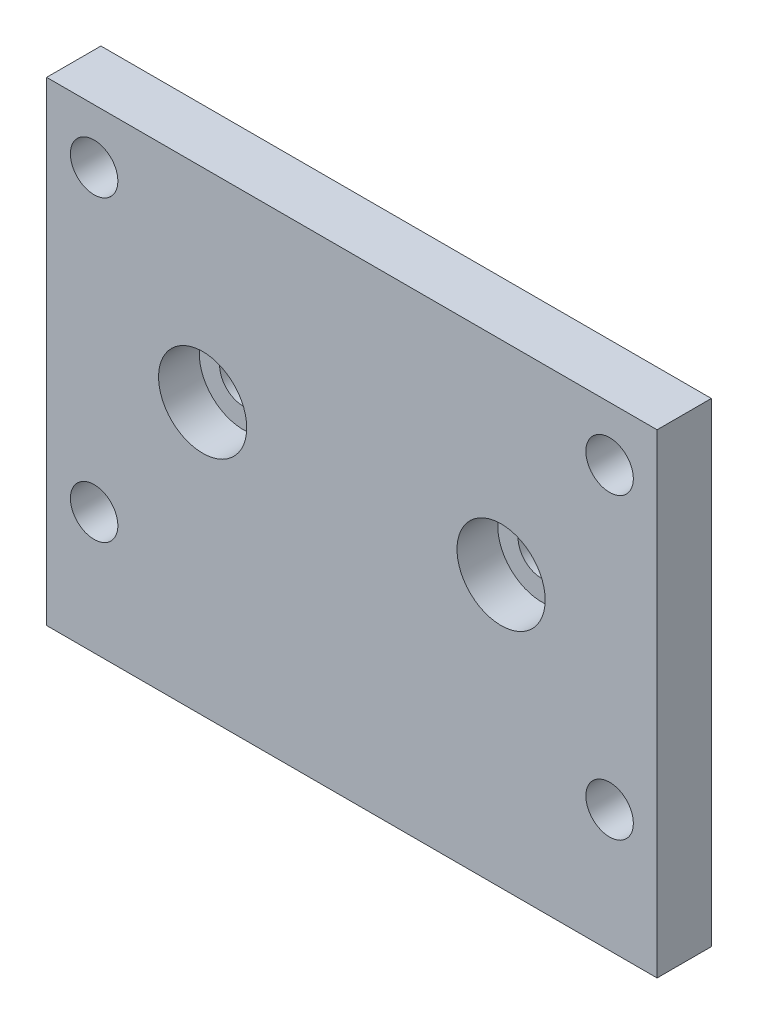
ISO-10303-21;
HEADER;
FILE_DESCRIPTION(('STEP AP214'),'2;1');
FILE_NAME('part.step','',(''),(''),'','','');
FILE_SCHEMA(('AUTOMOTIVE_DESIGN { 1 0 10303 214 1 1 1 1 }'));
ENDSEC;
DATA;
#1=APPLICATION_CONTEXT('core data for automotive mechanical design processes');
#2=APPLICATION_PROTOCOL_DEFINITION('international standard','automotive_design',2000,#1);
#3=PRODUCT_CONTEXT('',#1,'mechanical');
#4=PRODUCT('Part','Part','',(#3));
#5=PRODUCT_RELATED_PRODUCT_CATEGORY('part','',(#4));
#6=PRODUCT_DEFINITION_FORMATION('','',#4);
#7=PRODUCT_DEFINITION_CONTEXT('part definition',#1,'design');
#8=PRODUCT_DEFINITION('design','',#6,#7);
#9=PRODUCT_DEFINITION_SHAPE('','',#8);
#10=(LENGTH_UNIT() NAMED_UNIT(*) SI_UNIT(.MILLI.,.METRE.));
#11=(NAMED_UNIT(*) PLANE_ANGLE_UNIT() SI_UNIT($,.RADIAN.));
#12=(NAMED_UNIT(*) SI_UNIT($,.STERADIAN.) SOLID_ANGLE_UNIT());
#13=UNCERTAINTY_MEASURE_WITH_UNIT(LENGTH_MEASURE(1.E-05),#10,'distance_accuracy_value','');
#14=(GEOMETRIC_REPRESENTATION_CONTEXT(3) GLOBAL_UNCERTAINTY_ASSIGNED_CONTEXT((#13)) GLOBAL_UNIT_ASSIGNED_CONTEXT((#10,
#11,#12)) REPRESENTATION_CONTEXT('',''));
#15=CARTESIAN_POINT('',(0.,0.,0.));
#16=DIRECTION('',(0.,0.,1.));
#17=DIRECTION('',(1.,0.,0.));
#18=AXIS2_PLACEMENT_3D('',#15,#16,#17);
#19=CARTESIAN_POINT('',(11.,2.5,0.));
#20=DIRECTION('',(0.,0.,1.));
#21=DIRECTION('',(1.,0.,0.));
#22=AXIS2_PLACEMENT_3D('',#19,#20,#21);
#23=CYLINDRICAL_SURFACE('',#22,1.75);
#24=CARTESIAN_POINT('',(11.,2.5,0.));
#25=DIRECTION('',(0.,0.,1.));
#26=DIRECTION('',(1.,0.,0.));
#27=AXIS2_PLACEMENT_3D('',#24,#25,#26);
#28=CIRCLE('',#27,1.75);
#29=CARTESIAN_POINT('',(12.75,2.5,0.));
#30=VERTEX_POINT('',#29);
#31=EDGE_CURVE('E111',#30,#30,#28,.T.);
#32=ORIENTED_EDGE('',*,*,#31,.F.);
#33=EDGE_LOOP('',(#32));
#34=FACE_BOUND('',#33,.T.);
#35=CARTESIAN_POINT('',(11.,2.5,1.));
#36=DIRECTION('',(0.,0.,1.));
#37=DIRECTION('',(1.,0.,0.));
#38=AXIS2_PLACEMENT_3D('',#35,#36,#37);
#39=CIRCLE('',#38,1.75);
#40=CARTESIAN_POINT('',(12.75,2.5,1.));
#41=VERTEX_POINT('',#40);
#42=EDGE_CURVE('E38',#41,#41,#39,.F.);
#43=ORIENTED_EDGE('',*,*,#42,.F.);
#44=EDGE_LOOP('',(#43));
#45=FACE_BOUND('',#44,.T.);
#46=ADVANCED_FACE('F34',(#34,#45),#23,.F.);
#47=CARTESIAN_POINT('',(-11.,2.5,0.));
#48=DIRECTION('',(0.,0.,1.));
#49=DIRECTION('',(1.,0.,0.));
#50=AXIS2_PLACEMENT_3D('',#47,#48,#49);
#51=CYLINDRICAL_SURFACE('',#50,1.75);
#52=CARTESIAN_POINT('',(-11.,2.5,0.));
#53=DIRECTION('',(0.,0.,1.));
#54=DIRECTION('',(1.,0.,0.));
#55=AXIS2_PLACEMENT_3D('',#52,#53,#54);
#56=CIRCLE('',#55,1.75);
#57=CARTESIAN_POINT('',(-9.25,2.5,0.));
#58=VERTEX_POINT('',#57);
#59=EDGE_CURVE('E116',#58,#58,#56,.T.);
#60=ORIENTED_EDGE('',*,*,#59,.F.);
#61=EDGE_LOOP('',(#60));
#62=FACE_BOUND('',#61,.T.);
#63=CARTESIAN_POINT('',(-11.,2.5,1.));
#64=DIRECTION('',(0.,0.,1.));
#65=DIRECTION('',(1.,0.,0.));
#66=AXIS2_PLACEMENT_3D('',#63,#64,#65);
#67=CIRCLE('',#66,1.75);
#68=CARTESIAN_POINT('',(-9.25,2.5,1.));
#69=VERTEX_POINT('',#68);
#70=EDGE_CURVE('E109',#69,#69,#67,.F.);
#71=ORIENTED_EDGE('',*,*,#70,.F.);
#72=EDGE_LOOP('',(#71));
#73=FACE_BOUND('',#72,.T.);
#74=ADVANCED_FACE('F175',(#62,#73),#51,.F.);
#75=CARTESIAN_POINT('',(-22.5,-17.5,4.));
#76=DIRECTION('',(1.,0.,0.));
#77=DIRECTION('',(0.,0.,-1.));
#78=AXIS2_PLACEMENT_3D('',#75,#76,#77);
#79=PLANE('',#78);
#80=DIRECTION('',(0.,-1.,0.));
#81=VECTOR('',#80,1.);
#82=CARTESIAN_POINT('',(-22.5,-17.5,0.));
#83=LINE('',#82,#81);
#84=CARTESIAN_POINT('',(-22.5,17.5,0.));
#85=VERTEX_POINT('',#84);
#86=CARTESIAN_POINT('',(-22.5,-17.5,0.));
#87=VERTEX_POINT('',#86);
#88=EDGE_CURVE('E101',#85,#87,#83,.T.);
#89=ORIENTED_EDGE('',*,*,#88,.T.);
#90=DIRECTION('',(0.,0.,-1.));
#91=VECTOR('',#90,1.);
#92=CARTESIAN_POINT('',(-22.5,-17.5,4.));
#93=LINE('',#92,#91);
#94=CARTESIAN_POINT('',(-22.5,-17.5,4.));
#95=VERTEX_POINT('',#94);
#96=EDGE_CURVE('E11',#95,#87,#93,.T.);
#97=ORIENTED_EDGE('',*,*,#96,.F.);
#98=DIRECTION('',(0.,-1.,0.));
#99=VECTOR('',#98,1.);
#100=CARTESIAN_POINT('',(-22.5,-17.5,4.));
#101=LINE('',#100,#99);
#102=CARTESIAN_POINT('',(-22.5,17.5,4.));
#103=VERTEX_POINT('',#102);
#104=EDGE_CURVE('E88',#103,#95,#101,.T.);
#105=ORIENTED_EDGE('',*,*,#104,.F.);
#106=DIRECTION('',(0.,0.,-1.));
#107=VECTOR('',#106,1.);
#108=CARTESIAN_POINT('',(-22.5,17.5,4.));
#109=LINE('',#108,#107);
#110=EDGE_CURVE('E97',#103,#85,#109,.T.);
#111=ORIENTED_EDGE('',*,*,#110,.T.);
#112=EDGE_LOOP('',(#89,#97,#105,#111));
#113=FACE_BOUND('',#112,.T.);
#114=ADVANCED_FACE('F36',(#113),#79,.F.);
#115=CARTESIAN_POINT('',(22.5,-17.5,4.));
#116=DIRECTION('',(0.,1.,0.));
#117=DIRECTION('',(-1.,0.,0.));
#118=AXIS2_PLACEMENT_3D('',#115,#116,#117);
#119=PLANE('',#118);
#120=DIRECTION('',(1.,0.,0.));
#121=VECTOR('',#120,1.);
#122=CARTESIAN_POINT('',(22.5,-17.5,0.));
#123=LINE('',#122,#121);
#124=CARTESIAN_POINT('',(22.5,-17.5,0.));
#125=VERTEX_POINT('',#124);
#126=EDGE_CURVE('E92',#87,#125,#123,.T.);
#127=ORIENTED_EDGE('',*,*,#126,.T.);
#128=DIRECTION('',(0.,0.,-1.));
#129=VECTOR('',#128,1.);
#130=CARTESIAN_POINT('',(22.5,-17.5,4.));
#131=LINE('',#130,#129);
#132=CARTESIAN_POINT('',(22.5,-17.5,4.));
#133=VERTEX_POINT('',#132);
#134=EDGE_CURVE('E44',#133,#125,#131,.T.);
#135=ORIENTED_EDGE('',*,*,#134,.F.);
#136=DIRECTION('',(1.,0.,0.));
#137=VECTOR('',#136,1.);
#138=CARTESIAN_POINT('',(22.5,-17.5,4.));
#139=LINE('',#138,#137);
#140=EDGE_CURVE('E83',#95,#133,#139,.T.);
#141=ORIENTED_EDGE('',*,*,#140,.F.);
#142=ORIENTED_EDGE('',*,*,#96,.T.);
#143=EDGE_LOOP('',(#127,#135,#141,#142));
#144=FACE_BOUND('',#143,.T.);
#145=ADVANCED_FACE('F91',(#144),#119,.F.);
#146=CARTESIAN_POINT('',(22.5,-17.5,4.));
#147=DIRECTION('',(-1.,0.,0.));
#148=DIRECTION('',(0.,0.,1.));
#149=AXIS2_PLACEMENT_3D('',#146,#147,#148);
#150=PLANE('',#149);
#151=DIRECTION('',(0.,1.,0.));
#152=VECTOR('',#151,1.);
#153=CARTESIAN_POINT('',(22.5,-17.5,0.));
#154=LINE('',#153,#152);
#155=CARTESIAN_POINT('',(22.5,17.5,0.));
#156=VERTEX_POINT('',#155);
#157=EDGE_CURVE('E70',#125,#156,#154,.T.);
#158=ORIENTED_EDGE('',*,*,#157,.T.);
#159=DIRECTION('',(0.,0.,-1.));
#160=VECTOR('',#159,1.);
#161=CARTESIAN_POINT('',(22.5,17.5,4.));
#162=LINE('',#161,#160);
#163=CARTESIAN_POINT('',(22.5,17.5,4.));
#164=VERTEX_POINT('',#163);
#165=EDGE_CURVE('E93',#164,#156,#162,.T.);
#166=ORIENTED_EDGE('',*,*,#165,.F.);
#167=DIRECTION('',(0.,1.,0.));
#168=VECTOR('',#167,1.);
#169=CARTESIAN_POINT('',(22.5,-17.5,4.));
#170=LINE('',#169,#168);
#171=EDGE_CURVE('E86',#133,#164,#170,.T.);
#172=ORIENTED_EDGE('',*,*,#171,.F.);
#173=ORIENTED_EDGE('',*,*,#134,.T.);
#174=EDGE_LOOP('',(#158,#166,#172,#173));
#175=FACE_BOUND('',#174,.T.);
#176=ADVANCED_FACE('F95',(#175),#150,.F.);
#177=CARTESIAN_POINT('',(22.5,17.5,4.));
#178=DIRECTION('',(0.,-1.,0.));
#179=DIRECTION('',(1.,0.,0.));
#180=AXIS2_PLACEMENT_3D('',#177,#178,#179);
#181=PLANE('',#180);
#182=DIRECTION('',(-1.,0.,0.));
#183=VECTOR('',#182,1.);
#184=CARTESIAN_POINT('',(22.5,17.5,0.));
#185=LINE('',#184,#183);
#186=EDGE_CURVE('E76',#156,#85,#185,.T.);
#187=ORIENTED_EDGE('',*,*,#186,.T.);
#188=ORIENTED_EDGE('',*,*,#110,.F.);
#189=DIRECTION('',(-1.,0.,0.));
#190=VECTOR('',#189,1.);
#191=CARTESIAN_POINT('',(22.5,17.5,4.));
#192=LINE('',#191,#190);
#193=EDGE_CURVE('E53',#164,#103,#192,.T.);
#194=ORIENTED_EDGE('',*,*,#193,.F.);
#195=ORIENTED_EDGE('',*,*,#165,.T.);
#196=EDGE_LOOP('',(#187,#188,#194,#195));
#197=FACE_BOUND('',#196,.T.);
#198=ADVANCED_FACE('F159',(#197),#181,.F.);
#199=CARTESIAN_POINT('',(0.,0.,4.));
#200=DIRECTION('',(0.,0.,1.));
#201=DIRECTION('',(1.,0.,0.));
#202=AXIS2_PLACEMENT_3D('',#199,#200,#201);
#203=PLANE('',#202);
#204=CARTESIAN_POINT('',(11.,2.5,4.));
#205=DIRECTION('',(0.,0.,1.));
#206=DIRECTION('',(1.,0.,0.));
#207=AXIS2_PLACEMENT_3D('',#204,#205,#206);
#208=CIRCLE('',#207,3.25);
#209=CARTESIAN_POINT('',(14.25,2.5,4.));
#210=VERTEX_POINT('',#209);
#211=EDGE_CURVE('E126',#210,#210,#208,.T.);
#212=ORIENTED_EDGE('',*,*,#211,.F.);
#213=EDGE_LOOP('',(#212));
#214=FACE_BOUND('',#213,.T.);
#215=CARTESIAN_POINT('',(-11.,2.5,4.));
#216=DIRECTION('',(0.,0.,1.));
#217=DIRECTION('',(1.,0.,0.));
#218=AXIS2_PLACEMENT_3D('',#215,#216,#217);
#219=CIRCLE('',#218,3.25);
#220=CARTESIAN_POINT('',(-7.75,2.5,4.));
#221=VERTEX_POINT('',#220);
#222=EDGE_CURVE('E119',#221,#221,#219,.T.);
#223=ORIENTED_EDGE('',*,*,#222,.F.);
#224=EDGE_LOOP('',(#223));
#225=FACE_BOUND('',#224,.T.);
#226=CARTESIAN_POINT('',(19.,-8.49999999999999,4.));
#227=DIRECTION('',(0.,0.,1.));
#228=DIRECTION('',(1.,0.,0.));
#229=AXIS2_PLACEMENT_3D('',#226,#227,#228);
#230=CIRCLE('',#229,1.75);
#231=CARTESIAN_POINT('',(20.75,-8.49999999999999,4.));
#232=VERTEX_POINT('',#231);
#233=EDGE_CURVE('E132',#232,#232,#230,.T.);
#234=ORIENTED_EDGE('',*,*,#233,.F.);
#235=EDGE_LOOP('',(#234));
#236=FACE_BOUND('',#235,.T.);
#237=CARTESIAN_POINT('',(19.,13.5,4.));
#238=DIRECTION('',(0.,0.,1.));
#239=DIRECTION('',(1.,0.,0.));
#240=AXIS2_PLACEMENT_3D('',#237,#238,#239);
#241=CIRCLE('',#240,1.75);
#242=CARTESIAN_POINT('',(20.75,13.5,4.));
#243=VERTEX_POINT('',#242);
#244=EDGE_CURVE('E138',#243,#243,#241,.T.);
#245=ORIENTED_EDGE('',*,*,#244,.F.);
#246=EDGE_LOOP('',(#245));
#247=FACE_BOUND('',#246,.T.);
#248=CARTESIAN_POINT('',(-19.,-8.5,4.));
#249=DIRECTION('',(0.,0.,1.));
#250=DIRECTION('',(1.,0.,0.));
#251=AXIS2_PLACEMENT_3D('',#248,#249,#250);
#252=CIRCLE('',#251,1.75);
#253=CARTESIAN_POINT('',(-17.25,-8.5,4.));
#254=VERTEX_POINT('',#253);
#255=EDGE_CURVE('E144',#254,#254,#252,.T.);
#256=ORIENTED_EDGE('',*,*,#255,.F.);
#257=EDGE_LOOP('',(#256));
#258=FACE_BOUND('',#257,.T.);
#259=CARTESIAN_POINT('',(-19.,13.5,4.));
#260=DIRECTION('',(0.,0.,1.));
#261=DIRECTION('',(1.,0.,0.));
#262=AXIS2_PLACEMENT_3D('',#259,#260,#261);
#263=CIRCLE('',#262,1.75);
#264=CARTESIAN_POINT('',(-17.25,13.5,4.));
#265=VERTEX_POINT('',#264);
#266=EDGE_CURVE('E147',#265,#265,#263,.T.);
#267=ORIENTED_EDGE('',*,*,#266,.F.);
#268=EDGE_LOOP('',(#267));
#269=FACE_BOUND('',#268,.T.);
#270=ORIENTED_EDGE('',*,*,#104,.T.);
#271=ORIENTED_EDGE('',*,*,#140,.T.);
#272=ORIENTED_EDGE('',*,*,#171,.T.);
#273=ORIENTED_EDGE('',*,*,#193,.T.);
#274=EDGE_LOOP('',(#270,#271,#272,#273));
#275=FACE_BOUND('',#274,.T.);
#276=ADVANCED_FACE('F84',(#214,#225,#236,#247,#258,#269,#275),#203,.T.);
#277=CARTESIAN_POINT('',(0.,0.,0.));
#278=DIRECTION('',(0.,0.,1.));
#279=DIRECTION('',(1.,0.,0.));
#280=AXIS2_PLACEMENT_3D('',#277,#278,#279);
#281=PLANE('',#280);
#282=ORIENTED_EDGE('',*,*,#31,.T.);
#283=EDGE_LOOP('',(#282));
#284=FACE_BOUND('',#283,.T.);
#285=ORIENTED_EDGE('',*,*,#59,.T.);
#286=EDGE_LOOP('',(#285));
#287=FACE_BOUND('',#286,.T.);
#288=CARTESIAN_POINT('',(19.,-8.49999999999999,0.));
#289=DIRECTION('',(0.,0.,1.));
#290=DIRECTION('',(1.,0.,0.));
#291=AXIS2_PLACEMENT_3D('',#288,#289,#290);
#292=CIRCLE('',#291,1.75);
#293=CARTESIAN_POINT('',(20.75,-8.49999999999999,0.));
#294=VERTEX_POINT('',#293);
#295=EDGE_CURVE('E131',#294,#294,#292,.T.);
#296=ORIENTED_EDGE('',*,*,#295,.T.);
#297=EDGE_LOOP('',(#296));
#298=FACE_BOUND('',#297,.T.);
#299=CARTESIAN_POINT('',(19.,13.5,0.));
#300=DIRECTION('',(0.,0.,1.));
#301=DIRECTION('',(1.,0.,0.));
#302=AXIS2_PLACEMENT_3D('',#299,#300,#301);
#303=CIRCLE('',#302,1.75);
#304=CARTESIAN_POINT('',(20.75,13.5,0.));
#305=VERTEX_POINT('',#304);
#306=EDGE_CURVE('E135',#305,#305,#303,.T.);
#307=ORIENTED_EDGE('',*,*,#306,.T.);
#308=EDGE_LOOP('',(#307));
#309=FACE_BOUND('',#308,.T.);
#310=CARTESIAN_POINT('',(-19.,-8.5,0.));
#311=DIRECTION('',(0.,0.,1.));
#312=DIRECTION('',(1.,0.,0.));
#313=AXIS2_PLACEMENT_3D('',#310,#311,#312);
#314=CIRCLE('',#313,1.75);
#315=CARTESIAN_POINT('',(-17.25,-8.5,0.));
#316=VERTEX_POINT('',#315);
#317=EDGE_CURVE('E141',#316,#316,#314,.T.);
#318=ORIENTED_EDGE('',*,*,#317,.T.);
#319=EDGE_LOOP('',(#318));
#320=FACE_BOUND('',#319,.T.);
#321=CARTESIAN_POINT('',(-19.,13.5,0.));
#322=DIRECTION('',(0.,0.,1.));
#323=DIRECTION('',(1.,0.,0.));
#324=AXIS2_PLACEMENT_3D('',#321,#322,#323);
#325=CIRCLE('',#324,1.75);
#326=CARTESIAN_POINT('',(-17.25,13.5,0.));
#327=VERTEX_POINT('',#326);
#328=EDGE_CURVE('E104',#327,#327,#325,.T.);
#329=ORIENTED_EDGE('',*,*,#328,.T.);
#330=EDGE_LOOP('',(#329));
#331=FACE_BOUND('',#330,.T.);
#332=ORIENTED_EDGE('',*,*,#88,.F.);
#333=ORIENTED_EDGE('',*,*,#186,.F.);
#334=ORIENTED_EDGE('',*,*,#157,.F.);
#335=ORIENTED_EDGE('',*,*,#126,.F.);
#336=EDGE_LOOP('',(#332,#333,#334,#335));
#337=FACE_BOUND('',#336,.T.);
#338=ADVANCED_FACE('F158',(#284,#287,#298,#309,#320,#331,#337),#281,.F.);
#339=CARTESIAN_POINT('',(-19.,13.5,0.));
#340=DIRECTION('',(0.,0.,1.));
#341=DIRECTION('',(1.,0.,0.));
#342=AXIS2_PLACEMENT_3D('',#339,#340,#341);
#343=CYLINDRICAL_SURFACE('',#342,1.75);
#344=ORIENTED_EDGE('',*,*,#328,.F.);
#345=EDGE_LOOP('',(#344));
#346=FACE_BOUND('',#345,.T.);
#347=ORIENTED_EDGE('',*,*,#266,.T.);
#348=EDGE_LOOP('',(#347));
#349=FACE_BOUND('',#348,.T.);
#350=ADVANCED_FACE('F155',(#346,#349),#343,.F.);
#351=CARTESIAN_POINT('',(-19.,-8.5,0.));
#352=DIRECTION('',(0.,0.,1.));
#353=DIRECTION('',(1.,0.,0.));
#354=AXIS2_PLACEMENT_3D('',#351,#352,#353);
#355=CYLINDRICAL_SURFACE('',#354,1.75);
#356=ORIENTED_EDGE('',*,*,#317,.F.);
#357=EDGE_LOOP('',(#356));
#358=FACE_BOUND('',#357,.T.);
#359=ORIENTED_EDGE('',*,*,#255,.T.);
#360=EDGE_LOOP('',(#359));
#361=FACE_BOUND('',#360,.T.);
#362=ADVANCED_FACE('F197',(#358,#361),#355,.F.);
#363=CARTESIAN_POINT('',(19.,13.5,0.));
#364=DIRECTION('',(0.,0.,1.));
#365=DIRECTION('',(1.,0.,0.));
#366=AXIS2_PLACEMENT_3D('',#363,#364,#365);
#367=CYLINDRICAL_SURFACE('',#366,1.75);
#368=ORIENTED_EDGE('',*,*,#306,.F.);
#369=EDGE_LOOP('',(#368));
#370=FACE_BOUND('',#369,.T.);
#371=ORIENTED_EDGE('',*,*,#244,.T.);
#372=EDGE_LOOP('',(#371));
#373=FACE_BOUND('',#372,.T.);
#374=ADVANCED_FACE('F193',(#370,#373),#367,.F.);
#375=CARTESIAN_POINT('',(19.,-8.49999999999999,0.));
#376=DIRECTION('',(0.,0.,1.));
#377=DIRECTION('',(1.,0.,0.));
#378=AXIS2_PLACEMENT_3D('',#375,#376,#377);
#379=CYLINDRICAL_SURFACE('',#378,1.75);
#380=ORIENTED_EDGE('',*,*,#295,.F.);
#381=EDGE_LOOP('',(#380));
#382=FACE_BOUND('',#381,.T.);
#383=ORIENTED_EDGE('',*,*,#233,.T.);
#384=EDGE_LOOP('',(#383));
#385=FACE_BOUND('',#384,.T.);
#386=ADVANCED_FACE('F189',(#382,#385),#379,.F.);
#387=CARTESIAN_POINT('',(-11.,2.5,1.));
#388=DIRECTION('',(0.,0.,1.));
#389=DIRECTION('',(1.,0.,0.));
#390=AXIS2_PLACEMENT_3D('',#387,#388,#389);
#391=PLANE('',#390);
#392=CARTESIAN_POINT('',(-11.,2.5,1.));
#393=DIRECTION('',(0.,0.,1.));
#394=DIRECTION('',(1.,0.,0.));
#395=AXIS2_PLACEMENT_3D('',#392,#393,#394);
#396=CIRCLE('',#395,3.25);
#397=CARTESIAN_POINT('',(-7.75,2.5,1.));
#398=VERTEX_POINT('',#397);
#399=EDGE_CURVE('E112',#398,#398,#396,.T.);
#400=ORIENTED_EDGE('',*,*,#399,.T.);
#401=EDGE_LOOP('',(#400));
#402=FACE_BOUND('',#401,.T.);
#403=ORIENTED_EDGE('',*,*,#70,.T.);
#404=EDGE_LOOP('',(#403));
#405=FACE_BOUND('',#404,.T.);
#406=ADVANCED_FACE('F192',(#402,#405),#391,.T.);
#407=CARTESIAN_POINT('',(-11.,2.5,1.));
#408=DIRECTION('',(0.,0.,1.));
#409=DIRECTION('',(1.,0.,0.));
#410=AXIS2_PLACEMENT_3D('',#407,#408,#409);
#411=CYLINDRICAL_SURFACE('',#410,3.25);
#412=ORIENTED_EDGE('',*,*,#399,.F.);
#413=EDGE_LOOP('',(#412));
#414=FACE_BOUND('',#413,.T.);
#415=ORIENTED_EDGE('',*,*,#222,.T.);
#416=EDGE_LOOP('',(#415));
#417=FACE_BOUND('',#416,.T.);
#418=ADVANCED_FACE('F186',(#414,#417),#411,.F.);
#419=CARTESIAN_POINT('',(11.,2.5,1.));
#420=DIRECTION('',(0.,0.,1.));
#421=DIRECTION('',(1.,0.,0.));
#422=AXIS2_PLACEMENT_3D('',#419,#420,#421);
#423=PLANE('',#422);
#424=CARTESIAN_POINT('',(11.,2.5,1.));
#425=DIRECTION('',(0.,0.,1.));
#426=DIRECTION('',(1.,0.,0.));
#427=AXIS2_PLACEMENT_3D('',#424,#425,#426);
#428=CIRCLE('',#427,3.25);
#429=CARTESIAN_POINT('',(14.25,2.5,1.));
#430=VERTEX_POINT('',#429);
#431=EDGE_CURVE('E303',#430,#430,#428,.T.);
#432=ORIENTED_EDGE('',*,*,#431,.T.);
#433=EDGE_LOOP('',(#432));
#434=FACE_BOUND('',#433,.T.);
#435=ORIENTED_EDGE('',*,*,#42,.T.);
#436=EDGE_LOOP('',(#435));
#437=FACE_BOUND('',#436,.T.);
#438=ADVANCED_FACE('F274',(#434,#437),#423,.T.);
#439=CARTESIAN_POINT('',(11.,2.5,1.));
#440=DIRECTION('',(0.,0.,1.));
#441=DIRECTION('',(1.,0.,0.));
#442=AXIS2_PLACEMENT_3D('',#439,#440,#441);
#443=CYLINDRICAL_SURFACE('',#442,3.25);
#444=ORIENTED_EDGE('',*,*,#431,.F.);
#445=EDGE_LOOP('',(#444));
#446=FACE_BOUND('',#445,.T.);
#447=ORIENTED_EDGE('',*,*,#211,.T.);
#448=EDGE_LOOP('',(#447));
#449=FACE_BOUND('',#448,.T.);
#450=ADVANCED_FACE('F281',(#446,#449),#443,.F.);
#451=CLOSED_SHELL('',(#46,#74,#114,#145,#176,#198,#276,#338,#350,#362,#374,#386,#406,#418,#438,#450));
#452=MANIFOLD_SOLID_BREP('B2',#451);
#453=ADVANCED_BREP_SHAPE_REPRESENTATION('',(#18,#452),#14);
#454=SHAPE_DEFINITION_REPRESENTATION(#9,#453);
ENDSEC;
END-ISO-10303-21;
